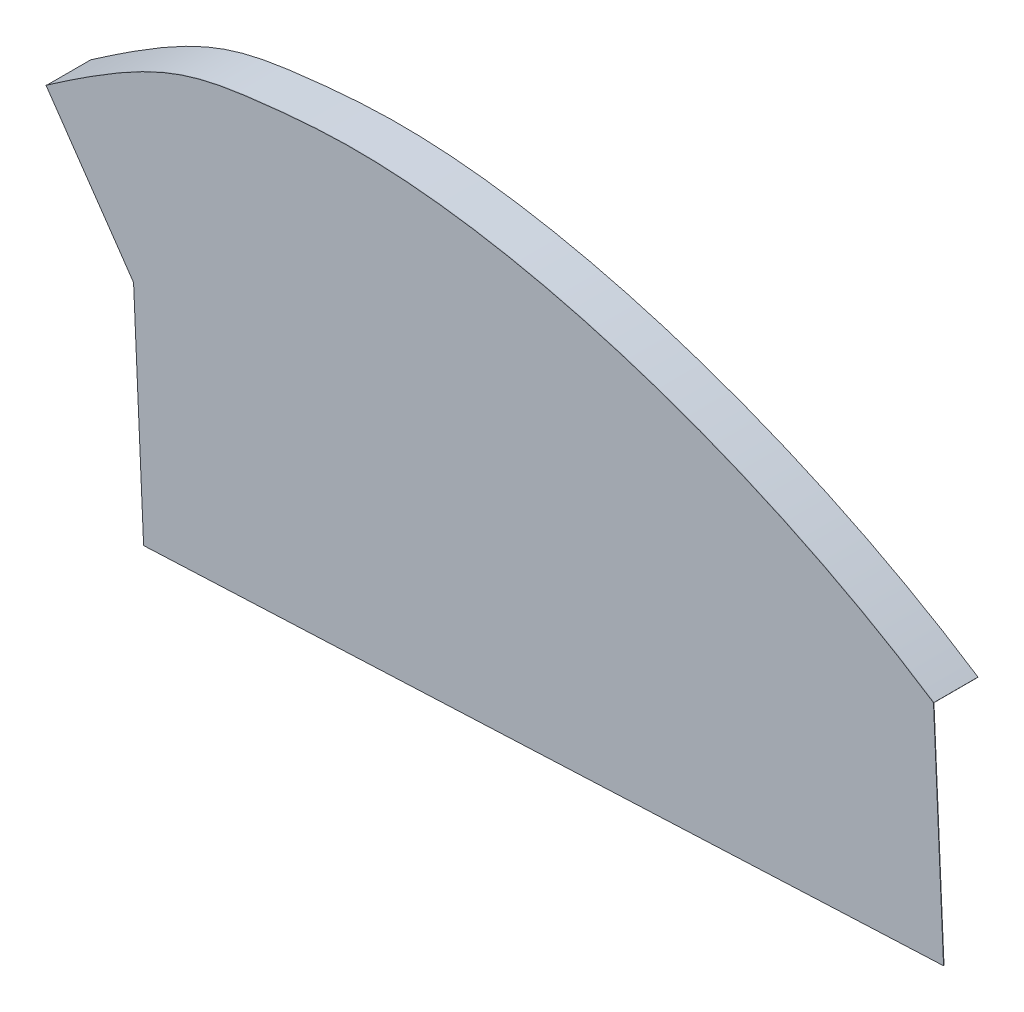
ISO-10303-21;
HEADER;
FILE_DESCRIPTION(('STEP AP214'),'2;1');
FILE_NAME('part.step','',(''),(''),'','','');
FILE_SCHEMA(('AUTOMOTIVE_DESIGN { 1 0 10303 214 1 1 1 1 }'));
ENDSEC;
DATA;
#1=APPLICATION_CONTEXT('core data for automotive mechanical design processes');
#2=APPLICATION_PROTOCOL_DEFINITION('international standard','automotive_design',2000,#1);
#3=PRODUCT_CONTEXT('',#1,'mechanical');
#4=PRODUCT('Part','Part','',(#3));
#5=PRODUCT_RELATED_PRODUCT_CATEGORY('part','',(#4));
#6=PRODUCT_DEFINITION_FORMATION('','',#4);
#7=PRODUCT_DEFINITION_CONTEXT('part definition',#1,'design');
#8=PRODUCT_DEFINITION('design','',#6,#7);
#9=PRODUCT_DEFINITION_SHAPE('','',#8);
#10=(LENGTH_UNIT() NAMED_UNIT(*) SI_UNIT(.MILLI.,.METRE.));
#11=(NAMED_UNIT(*) PLANE_ANGLE_UNIT() SI_UNIT($,.RADIAN.));
#12=(NAMED_UNIT(*) SI_UNIT($,.STERADIAN.) SOLID_ANGLE_UNIT());
#13=UNCERTAINTY_MEASURE_WITH_UNIT(LENGTH_MEASURE(1.E-05),#10,'distance_accuracy_value','');
#14=(GEOMETRIC_REPRESENTATION_CONTEXT(3) GLOBAL_UNCERTAINTY_ASSIGNED_CONTEXT((#13)) GLOBAL_UNIT_ASSIGNED_CONTEXT((#10,
#11,#12)) REPRESENTATION_CONTEXT('',''));
#15=CARTESIAN_POINT('',(0.,0.,0.));
#16=DIRECTION('',(0.,0.,1.));
#17=DIRECTION('',(1.,0.,0.));
#18=AXIS2_PLACEMENT_3D('',#15,#16,#17);
#19=CARTESIAN_POINT('',(-1659.53553734202,615.24308702669,0.));
#20=DIRECTION('',(0.,0.,1.));
#21=DIRECTION('',(1.,0.,0.));
#22=AXIS2_PLACEMENT_3D('',#19,#20,#21);
#23=PLANE('',#22);
#24=CARTESIAN_POINT('',(-1544.64995665935,573.441433080312,0.));
#25=CARTESIAN_POINT('',(-1585.71664888804,600.423930322912,0.));
#26=CARTESIAN_POINT('',(-1646.28028973819,619.241808081414,0.));
#27=CARTESIAN_POINT('',(-1709.38954114273,613.399774738818,0.));
#28=CARTESIAN_POINT('',(-1719.50790421298,610.537812827554,0.));
#29=CARTESIAN_POINT('',(-1743.60796018332,593.83047017767,0.));
#30=B_SPLINE_CURVE_WITH_KNOTS('',3,(#24,#25,#26,#27,#28,#29),.UNSPECIFIED.,.F.,.F.,(4,1,1,4),
(0.,0.579445357910707,0.679445357910707,1.),.UNSPECIFIED.);
#31=CARTESIAN_POINT('',(-1544.64995665935,573.441433080312,0.));
#32=VERTEX_POINT('',#31);
#33=CARTESIAN_POINT('',(-1743.60796018332,593.83047017767,0.));
#34=VERTEX_POINT('',#33);
#35=EDGE_CURVE('E122',#32,#34,#30,.T.);
#36=ORIENTED_EDGE('',*,*,#35,.F.);
#37=DIRECTION('',(-0.0450522481090854,0.998984631984055,0.));
#38=VECTOR('',#37,1.);
#39=CARTESIAN_POINT('',(-1544.64995665935,573.441433080312,0.));
#40=LINE('',#39,#38);
#41=CARTESIAN_POINT('',(-1542.39734425389,523.492201481109,0.));
#42=VERTEX_POINT('',#41);
#43=EDGE_CURVE('E82',#42,#32,#40,.T.);
#44=ORIENTED_EDGE('',*,*,#43,.F.);
#45=DIRECTION('',(0.998984631984055,0.0450522481090856,0.));
#46=VECTOR('',#45,1.);
#47=CARTESIAN_POINT('',(-1542.39734425389,523.492201481109,0.));
#48=LINE('',#47,#46);
#49=CARTESIAN_POINT('',(-1721.7229636347,515.404967665896,0.));
#50=VERTEX_POINT('',#49);
#51=EDGE_CURVE('E134',#50,#42,#48,.T.);
#52=ORIENTED_EDGE('',*,*,#51,.F.);
#53=DIRECTION('',(0.0450522481090854,-0.998984631984055,0.));
#54=VECTOR('',#53,1.);
#55=CARTESIAN_POINT('',(-1723.97557604015,565.354199265099,0.));
#56=LINE('',#55,#54);
#57=CARTESIAN_POINT('',(-1723.97557604015,565.354199265099,0.));
#58=VERTEX_POINT('',#57);
#59=EDGE_CURVE('E110',#58,#50,#56,.T.);
#60=ORIENTED_EDGE('',*,*,#59,.F.);
#61=DIRECTION('',(0.567607096396232,-0.823299571310856,0.));
#62=VECTOR('',#61,1.);
#63=CARTESIAN_POINT('',(-1743.60796018332,593.83047017767,0.));
#64=LINE('',#63,#62);
#65=EDGE_CURVE('E127',#34,#58,#64,.T.);
#66=ORIENTED_EDGE('',*,*,#65,.F.);
#67=EDGE_LOOP('',(#36,#44,#52,#60,#66));
#68=FACE_BOUND('',#67,.T.);
#69=DIRECTION('',(-0.549118385868169,-0.835744577189428,0.));
#70=VECTOR('',#69,1.);
#71=CARTESIAN_POINT('',(-1560.10779243697,549.914990042341,0.));
#72=LINE('',#71,#70);
#73=CARTESIAN_POINT('',(-1544.67741257864,573.399645851452,0.));
#74=VERTEX_POINT('',#73);
#75=CARTESIAN_POINT('',(-1544.73232441723,573.316071393733,0.));
#76=VERTEX_POINT('',#75);
#77=EDGE_CURVE('E11',#74,#76,#72,.T.);
#78=ORIENTED_EDGE('',*,*,#77,.F.);
#79=CARTESIAN_POINT('',(-1544.67741257864,573.399645851452,0.));
#80=CARTESIAN_POINT('',(-1580.10630688182,596.677879158398,0.));
#81=CARTESIAN_POINT('',(-1623.41727661125,611.817205851016,0.));
#82=CARTESIAN_POINT('',(-1664.05555432562,615.615316248625,0.));
#83=CARTESIAN_POINT('',(-1668.45858748525,615.853546331745,0.));
#84=CARTESIAN_POINT('',(-1674.85045688565,615.924640205925,0.));
#85=CARTESIAN_POINT('',(-1676.94707234617,615.898899542227,0.));
#86=CARTESIAN_POINT('',(-1681.053950245,615.760083503958,0.));
#87=CARTESIAN_POINT('',(-1685.070934683,615.538033819222,0.));
#88=CARTESIAN_POINT('',(-1688.84153528557,615.206941308899,0.));
#89=CARTESIAN_POINT('',(-1692.45566082211,614.850042830177,0.));
#90=CARTESIAN_POINT('',(-1694.1825533992,614.660043123166,0.));
#91=CARTESIAN_POINT('',(-1699.09217730466,614.084892782621,0.));
#92=CARTESIAN_POINT('',(-1702.0267403375,613.678931578794,0.));
#93=CARTESIAN_POINT('',(-1710.3914540648,612.076086015253,0.));
#94=CARTESIAN_POINT('',(-1715.38281240301,610.494610735516,0.));
#95=CARTESIAN_POINT('',(-1727.27852043395,604.608644100186,0.));
#96=CARTESIAN_POINT('',(-1734.18262553921,600.30373530969,0.));
#97=CARTESIAN_POINT('',(-1743.57947353923,593.789378680877,0.));
#98=B_SPLINE_CURVE_WITH_KNOTS('',3,(#79,#80,#81,#82,#83,#84,#85,#86,#87,#88,#89,#90,#91,#92,#93,
#94,#95,#96,#97),.UNSPECIFIED.,.F.,.F.,(4,2,2,2,1,2,2,2,2,4),(0.,0.499999999999989,
0.562499999999988,0.593749999999988,0.624999999999989,0.65624999999999,0.687499999999991,
0.749999999999993,0.874999999999996,1.),.UNSPECIFIED.);
#99=CARTESIAN_POINT('',(-1743.57947353923,593.789378680877,0.));
#100=VERTEX_POINT('',#99);
#101=EDGE_CURVE('E143',#74,#100,#98,.T.);
#102=ORIENTED_EDGE('',*,*,#101,.T.);
#103=DIRECTION('',(0.569732881743784,-0.821829935850431,0.));
#104=VECTOR('',#103,1.);
#105=CARTESIAN_POINT('',(-1726.34431651298,568.927959501592,0.));
#106=LINE('',#105,#104);
#107=CARTESIAN_POINT('',(-1743.52250025105,593.707195687292,0.));
#108=VERTEX_POINT('',#107);
#109=EDGE_CURVE('E148',#100,#108,#106,.T.);
#110=ORIENTED_EDGE('',*,*,#109,.T.);
#111=CARTESIAN_POINT('',(-1544.73232441723,573.316071393733,0.));
#112=CARTESIAN_POINT('',(-1546.9519488348,574.774455463074,0.));
#113=CARTESIAN_POINT('',(-1551.43127800974,577.613556033188,0.));
#114=CARTESIAN_POINT('',(-1560.62942944249,583.045346230826,0.));
#115=CARTESIAN_POINT('',(-1572.47093595197,589.326889692186,0.));
#116=CARTESIAN_POINT('',(-1587.0698673746,596.019330748109,0.));
#117=CARTESIAN_POINT('',(-1606.81265126061,603.755089395571,0.));
#118=CARTESIAN_POINT('',(-1626.62090438922,609.625271880809,0.));
#119=CARTESIAN_POINT('',(-1645.78545252912,613.461587482119,0.));
#120=CARTESIAN_POINT('',(-1659.66402273344,615.275078476153,0.));
#121=CARTESIAN_POINT('',(-1672.85543086534,616.000525973034,0.));
#122=CARTESIAN_POINT('',(-1683.17584633953,615.607177852822,0.));
#123=CARTESIAN_POINT('',(-1690.71915152159,614.940047919185,0.));
#124=CARTESIAN_POINT('',(-1697.61941057258,614.184343592506,0.));
#125=CARTESIAN_POINT('',(-1704.94143994043,613.175751133432,0.));
#126=CARTESIAN_POINT('',(-1711.53706287152,611.5205858769,0.));
#127=CARTESIAN_POINT('',(-1716.95073175608,609.496349747706,0.));
#128=CARTESIAN_POINT('',(-1721.22633977372,607.547139739651,0.));
#129=CARTESIAN_POINT('',(-1725.86182003669,605.087085053395,0.));
#130=CARTESIAN_POINT('',(-1730.14437771435,602.544994912,0.));
#131=CARTESIAN_POINT('',(-1733.8948142354,600.175895508009,0.));
#132=CARTESIAN_POINT('',(-1736.8860842667,598.222624563629,0.));
#133=CARTESIAN_POINT('',(-1739.54836201676,596.435520579365,0.));
#134=CARTESIAN_POINT('',(-1741.77568270842,594.914415574359,0.));
#135=CARTESIAN_POINT('',(-1742.94582133205,594.106977841768,0.));
#136=CARTESIAN_POINT('',(-1743.52250025105,593.707195687292,0.));
#137=B_SPLINE_CURVE_WITH_KNOTS('',3,(#111,#112,#113,#114,#115,#116,#117,#118,#119,#120,#121,
#122,#123,#124,#125,#126,#127,#128,#129,#130,#131,#132,#133,#134,#135,#136),.UNSPECIFIED.,.F.,
.F.,(4,1,1,1,1,1,1,1,1,1,1,1,1,1,1,1,1,1,1,1,1,1,1,4),(0.,0.03125,0.0625,0.125,0.1875,0.25,
0.375,0.4375,0.5,0.5625,0.625,0.65625,0.6875,0.75,0.8125,0.84375,0.875,0.90625,0.9375,0.953125,
0.96875,0.984375,0.9921875,1.),.UNSPECIFIED.);
#138=EDGE_CURVE('E42',#76,#108,#137,.T.);
#139=ORIENTED_EDGE('',*,*,#138,.F.);
#140=EDGE_LOOP('',(#78,#102,#110,#139));
#141=FACE_BOUND('',#140,.T.);
#142=ADVANCED_FACE('F33',(#68,#141),#23,.F.);
#143=CARTESIAN_POINT('',(-1544.64995665935,573.441433080312,0.1));
#144=CARTESIAN_POINT('',(-1585.71664888804,600.423930322912,0.1));
#145=CARTESIAN_POINT('',(-1646.28028973819,619.241808081414,0.1));
#146=CARTESIAN_POINT('',(-1709.38954114273,613.399774738818,0.1));
#147=CARTESIAN_POINT('',(-1719.50790421298,610.537812827554,0.1));
#148=CARTESIAN_POINT('',(-1743.60796018332,593.83047017767,0.1));
#149=B_SPLINE_CURVE_WITH_KNOTS('',3,(#143,#144,#145,#146,#147,#148),.UNSPECIFIED.,.F.,.F.,(4,1,
1,4),(0.,0.579445357910707,0.679445357910707,1.),.UNSPECIFIED.);
#150=DIRECTION('',(0.,0.,-1.));
#151=VECTOR('',#150,1.);
#152=SURFACE_OF_LINEAR_EXTRUSION('',#149,#151);
#153=ORIENTED_EDGE('',*,*,#35,.T.);
#154=DIRECTION('',(0.,0.,-1.));
#155=VECTOR('',#154,1.);
#156=CARTESIAN_POINT('',(-1743.60796018332,593.83047017767,0.1));
#157=LINE('',#156,#155);
#158=CARTESIAN_POINT('',(-1743.60796018332,593.83047017767,0.1));
#159=VERTEX_POINT('',#158);
#160=EDGE_CURVE('E141',#159,#34,#157,.T.);
#161=ORIENTED_EDGE('',*,*,#160,.F.);
#162=CARTESIAN_POINT('',(-1544.64995665935,573.441433080312,0.1));
#163=VERTEX_POINT('',#162);
#164=EDGE_CURVE('E137',#163,#159,#149,.T.);
#165=ORIENTED_EDGE('',*,*,#164,.F.);
#166=DIRECTION('',(0.,0.,-1.));
#167=VECTOR('',#166,1.);
#168=CARTESIAN_POINT('',(-1544.64995665935,573.441433080312,0.1));
#169=LINE('',#168,#167);
#170=EDGE_CURVE('E118',#163,#32,#169,.T.);
#171=ORIENTED_EDGE('',*,*,#170,.T.);
#172=EDGE_LOOP('',(#153,#161,#165,#171));
#173=FACE_BOUND('',#172,.T.);
#174=ADVANCED_FACE('F35',(#173),#152,.F.);
#175=CARTESIAN_POINT('',(-1743.60796018332,593.83047017767,0.1));
#176=DIRECTION('',(0.823299571310856,0.567607096396232,0.));
#177=DIRECTION('',(-0.567607096396232,0.823299571310856,0.));
#178=AXIS2_PLACEMENT_3D('',#175,#176,#177);
#179=PLANE('',#178);
#180=ORIENTED_EDGE('',*,*,#65,.T.);
#181=DIRECTION('',(0.,0.,-1.));
#182=VECTOR('',#181,1.);
#183=CARTESIAN_POINT('',(-1723.97557604015,565.354199265099,0.1));
#184=LINE('',#183,#182);
#185=CARTESIAN_POINT('',(-1723.97557604015,565.354199265099,0.1));
#186=VERTEX_POINT('',#185);
#187=EDGE_CURVE('E113',#186,#58,#184,.T.);
#188=ORIENTED_EDGE('',*,*,#187,.F.);
#189=DIRECTION('',(0.567607096396232,-0.823299571310856,0.));
#190=VECTOR('',#189,1.);
#191=CARTESIAN_POINT('',(-1743.60796018332,593.83047017767,0.1));
#192=LINE('',#191,#190);
#193=EDGE_CURVE('E91',#159,#186,#192,.T.);
#194=ORIENTED_EDGE('',*,*,#193,.F.);
#195=ORIENTED_EDGE('',*,*,#160,.T.);
#196=EDGE_LOOP('',(#180,#188,#194,#195));
#197=FACE_BOUND('',#196,.T.);
#198=ADVANCED_FACE('F207',(#197),#179,.F.);
#199=CARTESIAN_POINT('',(-1723.97557604015,565.354199265099,0.1));
#200=DIRECTION('',(0.998984631984055,0.0450522481090854,0.));
#201=DIRECTION('',(-0.0450522481090854,0.998984631984055,0.));
#202=AXIS2_PLACEMENT_3D('',#199,#200,#201);
#203=PLANE('',#202);
#204=ORIENTED_EDGE('',*,*,#59,.T.);
#205=DIRECTION('',(0.,0.,-1.));
#206=VECTOR('',#205,1.);
#207=CARTESIAN_POINT('',(-1721.7229636347,515.404967665896,0.1));
#208=LINE('',#207,#206);
#209=CARTESIAN_POINT('',(-1721.7229636347,515.404967665896,0.1));
#210=VERTEX_POINT('',#209);
#211=EDGE_CURVE('E107',#210,#50,#208,.T.);
#212=ORIENTED_EDGE('',*,*,#211,.F.);
#213=DIRECTION('',(0.0450522481090854,-0.998984631984055,0.));
#214=VECTOR('',#213,1.);
#215=CARTESIAN_POINT('',(-1723.97557604015,565.354199265099,0.1));
#216=LINE('',#215,#214);
#217=EDGE_CURVE('E97',#186,#210,#216,.T.);
#218=ORIENTED_EDGE('',*,*,#217,.F.);
#219=ORIENTED_EDGE('',*,*,#187,.T.);
#220=EDGE_LOOP('',(#204,#212,#218,#219));
#221=FACE_BOUND('',#220,.T.);
#222=ADVANCED_FACE('F108',(#221),#203,.F.);
#223=CARTESIAN_POINT('',(-1542.39734425389,523.492201481109,0.1));
#224=DIRECTION('',(-0.0450522481090856,0.998984631984055,0.));
#225=DIRECTION('',(-0.998984631984055,-0.0450522481090857,0.));
#226=AXIS2_PLACEMENT_3D('',#223,#224,#225);
#227=PLANE('',#226);
#228=ORIENTED_EDGE('',*,*,#51,.T.);
#229=DIRECTION('',(0.,0.,-1.));
#230=VECTOR('',#229,1.);
#231=CARTESIAN_POINT('',(-1542.39734425389,523.492201481109,0.1));
#232=LINE('',#231,#230);
#233=CARTESIAN_POINT('',(-1542.39734425389,523.492201481109,0.1));
#234=VERTEX_POINT('',#233);
#235=EDGE_CURVE('E114',#234,#42,#232,.T.);
#236=ORIENTED_EDGE('',*,*,#235,.F.);
#237=DIRECTION('',(0.998984631984055,0.0450522481090856,0.));
#238=VECTOR('',#237,1.);
#239=CARTESIAN_POINT('',(-1542.39734425389,523.492201481109,0.1));
#240=LINE('',#239,#238);
#241=EDGE_CURVE('E101',#210,#234,#240,.T.);
#242=ORIENTED_EDGE('',*,*,#241,.F.);
#243=ORIENTED_EDGE('',*,*,#211,.T.);
#244=EDGE_LOOP('',(#228,#236,#242,#243));
#245=FACE_BOUND('',#244,.T.);
#246=ADVANCED_FACE('F116',(#245),#227,.F.);
#247=CARTESIAN_POINT('',(-1544.64995665935,573.441433080312,0.1));
#248=DIRECTION('',(-0.998984631984055,-0.0450522481090854,0.));
#249=DIRECTION('',(0.0450522481090854,-0.998984631984055,0.));
#250=AXIS2_PLACEMENT_3D('',#247,#248,#249);
#251=PLANE('',#250);
#252=ORIENTED_EDGE('',*,*,#43,.T.);
#253=ORIENTED_EDGE('',*,*,#170,.F.);
#254=DIRECTION('',(-0.0450522481090854,0.998984631984055,0.));
#255=VECTOR('',#254,1.);
#256=CARTESIAN_POINT('',(-1544.64995665935,573.441433080312,0.1));
#257=LINE('',#256,#255);
#258=EDGE_CURVE('E58',#234,#163,#257,.T.);
#259=ORIENTED_EDGE('',*,*,#258,.F.);
#260=ORIENTED_EDGE('',*,*,#235,.T.);
#261=EDGE_LOOP('',(#252,#253,#259,#260));
#262=FACE_BOUND('',#261,.T.);
#263=ADVANCED_FACE('F209',(#262),#251,.F.);
#264=CARTESIAN_POINT('',(-1659.53553734202,615.24308702669,0.1));
#265=DIRECTION('',(0.,0.,1.));
#266=DIRECTION('',(1.,0.,0.));
#267=AXIS2_PLACEMENT_3D('',#264,#265,#266);
#268=PLANE('',#267);
#269=ORIENTED_EDGE('',*,*,#164,.T.);
#270=ORIENTED_EDGE('',*,*,#193,.T.);
#271=ORIENTED_EDGE('',*,*,#217,.T.);
#272=ORIENTED_EDGE('',*,*,#241,.T.);
#273=ORIENTED_EDGE('',*,*,#258,.T.);
#274=EDGE_LOOP('',(#269,#270,#271,#272,#273));
#275=FACE_BOUND('',#274,.T.);
#276=ADVANCED_FACE('F99',(#275),#268,.T.);
#277=CARTESIAN_POINT('',(-1342.05540629883,881.785318824068,-9.9));
#278=DIRECTION('',(-0.835744577189428,0.549118385868169,0.));
#279=DIRECTION('',(-0.549118385868169,-0.835744577189428,0.));
#280=AXIS2_PLACEMENT_3D('',#277,#278,#279);
#281=PLANE('',#280);
#282=DIRECTION('',(0.,0.,1.));
#283=VECTOR('',#282,1.);
#284=CARTESIAN_POINT('',(-1544.67741257864,573.399645851452,-9.9));
#285=LINE('',#284,#283);
#286=CARTESIAN_POINT('',(-1544.67741257864,573.399645851452,-9.9));
#287=VERTEX_POINT('',#286);
#288=EDGE_CURVE('E183',#287,#74,#285,.T.);
#289=ORIENTED_EDGE('',*,*,#288,.T.);
#290=ORIENTED_EDGE('',*,*,#77,.T.);
#291=DIRECTION('',(0.,0.,1.));
#292=VECTOR('',#291,1.);
#293=CARTESIAN_POINT('',(-1544.73232441723,573.316071393733,-9.9));
#294=LINE('',#293,#292);
#295=CARTESIAN_POINT('',(-1544.73232441723,573.316071393733,-9.9));
#296=VERTEX_POINT('',#295);
#297=EDGE_CURVE('E128',#296,#76,#294,.T.);
#298=ORIENTED_EDGE('',*,*,#297,.F.);
#299=DIRECTION('',(-0.549118385868169,-0.835744577189428,0.));
#300=VECTOR('',#299,1.);
#301=CARTESIAN_POINT('',(-1342.05540629883,881.785318824068,-9.9));
#302=LINE('',#301,#300);
#303=EDGE_CURVE('E190',#287,#296,#302,.T.);
#304=ORIENTED_EDGE('',*,*,#303,.F.);
#305=EDGE_LOOP('',(#289,#290,#298,#304));
#306=FACE_BOUND('',#305,.T.);
#307=ADVANCED_FACE('F188',(#306),#281,.F.);
#308=CARTESIAN_POINT('',(-1544.73232441723,573.316071393733,-9.9));
#309=CARTESIAN_POINT('',(-1546.9519488348,574.774455463074,-9.9));
#310=CARTESIAN_POINT('',(-1551.43127800974,577.613556033188,-9.9));
#311=CARTESIAN_POINT('',(-1560.62942944249,583.045346230826,-9.9));
#312=CARTESIAN_POINT('',(-1572.47093595197,589.326889692186,-9.9));
#313=CARTESIAN_POINT('',(-1587.0698673746,596.019330748109,-9.9));
#314=CARTESIAN_POINT('',(-1606.81265126061,603.755089395571,-9.9));
#315=CARTESIAN_POINT('',(-1626.62090438922,609.625271880809,-9.9));
#316=CARTESIAN_POINT('',(-1645.78545252912,613.461587482119,-9.9));
#317=CARTESIAN_POINT('',(-1659.66402273344,615.275078476153,-9.9));
#318=CARTESIAN_POINT('',(-1672.85543086534,616.000525973034,-9.9));
#319=CARTESIAN_POINT('',(-1683.17584633953,615.607177852822,-9.9));
#320=CARTESIAN_POINT('',(-1690.71915152159,614.940047919185,-9.9));
#321=CARTESIAN_POINT('',(-1697.61941057258,614.184343592506,-9.9));
#322=CARTESIAN_POINT('',(-1704.94143994043,613.175751133432,-9.9));
#323=CARTESIAN_POINT('',(-1711.53706287152,611.5205858769,-9.9));
#324=CARTESIAN_POINT('',(-1716.95073175608,609.496349747706,-9.9));
#325=CARTESIAN_POINT('',(-1721.22633977372,607.547139739651,-9.9));
#326=CARTESIAN_POINT('',(-1725.86182003669,605.087085053395,-9.9));
#327=CARTESIAN_POINT('',(-1730.14437771435,602.544994912,-9.9));
#328=CARTESIAN_POINT('',(-1733.8948142354,600.175895508009,-9.9));
#329=CARTESIAN_POINT('',(-1736.8860842667,598.222624563629,-9.9));
#330=CARTESIAN_POINT('',(-1739.54836201676,596.435520579365,-9.9));
#331=CARTESIAN_POINT('',(-1741.77568270842,594.914415574359,-9.9));
#332=CARTESIAN_POINT('',(-1742.94582133205,594.106977841768,-9.9));
#333=CARTESIAN_POINT('',(-1743.52250025105,593.707195687292,-9.9));
#334=B_SPLINE_CURVE_WITH_KNOTS('',3,(#308,#309,#310,#311,#312,#313,#314,#315,#316,#317,#318,
#319,#320,#321,#322,#323,#324,#325,#326,#327,#328,#329,#330,#331,#332,#333),.UNSPECIFIED.,.F.,
.F.,(4,1,1,1,1,1,1,1,1,1,1,1,1,1,1,1,1,1,1,1,1,1,1,4),(0.,0.03125,0.0625,0.125,0.1875,0.25,
0.375,0.4375,0.5,0.5625,0.625,0.65625,0.6875,0.75,0.8125,0.84375,0.875,0.90625,0.9375,0.953125,
0.96875,0.984375,0.9921875,1.),.UNSPECIFIED.);
#335=DIRECTION('',(0.,0.,1.));
#336=VECTOR('',#335,1.);
#337=SURFACE_OF_LINEAR_EXTRUSION('',#334,#336);
#338=ORIENTED_EDGE('',*,*,#297,.T.);
#339=ORIENTED_EDGE('',*,*,#138,.T.);
#340=DIRECTION('',(0.,0.,1.));
#341=VECTOR('',#340,1.);
#342=CARTESIAN_POINT('',(-1743.52250025105,593.707195687292,-9.9));
#343=LINE('',#342,#341);
#344=CARTESIAN_POINT('',(-1743.52250025105,593.707195687292,-9.9));
#345=VERTEX_POINT('',#344);
#346=EDGE_CURVE('E168',#345,#108,#343,.T.);
#347=ORIENTED_EDGE('',*,*,#346,.F.);
#348=EDGE_CURVE('E192',#296,#345,#334,.T.);
#349=ORIENTED_EDGE('',*,*,#348,.F.);
#350=EDGE_LOOP('',(#338,#339,#347,#349));
#351=FACE_BOUND('',#350,.T.);
#352=ADVANCED_FACE('F165',(#351),#337,.F.);
#353=CARTESIAN_POINT('',(-899.595160445761,-623.643555443328,-9.9));
#354=DIRECTION('',(-0.821829935850431,-0.569732881743784,0.));
#355=DIRECTION('',(0.569732881743784,-0.821829935850431,0.));
#356=AXIS2_PLACEMENT_3D('',#353,#354,#355);
#357=PLANE('',#356);
#358=ORIENTED_EDGE('',*,*,#109,.F.);
#359=DIRECTION('',(0.,0.,1.));
#360=VECTOR('',#359,1.);
#361=CARTESIAN_POINT('',(-1743.57947353923,593.789378680877,-9.9));
#362=LINE('',#361,#360);
#363=CARTESIAN_POINT('',(-1743.57947353923,593.789378680877,-9.9));
#364=VERTEX_POINT('',#363);
#365=EDGE_CURVE('E49',#364,#100,#362,.T.);
#366=ORIENTED_EDGE('',*,*,#365,.F.);
#367=DIRECTION('',(0.569732881743784,-0.821829935850431,0.));
#368=VECTOR('',#367,1.);
#369=CARTESIAN_POINT('',(-899.595160445761,-623.643555443328,-9.9));
#370=LINE('',#369,#368);
#371=EDGE_CURVE('E177',#364,#345,#370,.T.);
#372=ORIENTED_EDGE('',*,*,#371,.T.);
#373=ORIENTED_EDGE('',*,*,#346,.T.);
#374=EDGE_LOOP('',(#358,#366,#372,#373));
#375=FACE_BOUND('',#374,.T.);
#376=ADVANCED_FACE('F175',(#375),#357,.T.);
#377=CARTESIAN_POINT('',(-1544.67741257864,573.399645851452,-9.9));
#378=CARTESIAN_POINT('',(-1580.10630688182,596.677879158398,-9.9));
#379=CARTESIAN_POINT('',(-1623.41727661125,611.817205851016,-9.9));
#380=CARTESIAN_POINT('',(-1664.05555432562,615.615316248625,-9.9));
#381=CARTESIAN_POINT('',(-1668.45858748525,615.853546331745,-9.9));
#382=CARTESIAN_POINT('',(-1674.85045688565,615.924640205925,-9.9));
#383=CARTESIAN_POINT('',(-1676.94707234617,615.898899542227,-9.9));
#384=CARTESIAN_POINT('',(-1681.053950245,615.760083503958,-9.9));
#385=CARTESIAN_POINT('',(-1685.070934683,615.538033819222,-9.9));
#386=CARTESIAN_POINT('',(-1688.84153528557,615.206941308899,-9.9));
#387=CARTESIAN_POINT('',(-1692.45566082211,614.850042830177,-9.9));
#388=CARTESIAN_POINT('',(-1694.1825533992,614.660043123166,-9.9));
#389=CARTESIAN_POINT('',(-1699.09217730466,614.084892782621,-9.9));
#390=CARTESIAN_POINT('',(-1702.0267403375,613.678931578794,-9.9));
#391=CARTESIAN_POINT('',(-1710.3914540648,612.076086015253,-9.9));
#392=CARTESIAN_POINT('',(-1715.38281240301,610.494610735516,-9.9));
#393=CARTESIAN_POINT('',(-1727.27852043395,604.608644100186,-9.9));
#394=CARTESIAN_POINT('',(-1734.18262553921,600.30373530969,-9.9));
#395=CARTESIAN_POINT('',(-1743.57947353923,593.789378680877,-9.9));
#396=B_SPLINE_CURVE_WITH_KNOTS('',3,(#377,#378,#379,#380,#381,#382,#383,#384,#385,#386,#387,
#388,#389,#390,#391,#392,#393,#394,#395),.UNSPECIFIED.,.F.,.F.,(4,2,2,2,1,2,2,2,2,4),(0.,
0.499999999999989,0.562499999999988,0.593749999999988,0.624999999999989,0.65624999999999,
0.687499999999991,0.749999999999993,0.874999999999996,1.),.UNSPECIFIED.);
#397=DIRECTION('',(0.,0.,1.));
#398=VECTOR('',#397,1.);
#399=SURFACE_OF_LINEAR_EXTRUSION('',#396,#398);
#400=ORIENTED_EDGE('',*,*,#101,.F.);
#401=ORIENTED_EDGE('',*,*,#288,.F.);
#402=EDGE_CURVE('E231',#287,#364,#396,.T.);
#403=ORIENTED_EDGE('',*,*,#402,.T.);
#404=ORIENTED_EDGE('',*,*,#365,.T.);
#405=EDGE_LOOP('',(#400,#401,#403,#404));
#406=FACE_BOUND('',#405,.T.);
#407=ADVANCED_FACE('F181',(#406),#399,.T.);
#408=CARTESIAN_POINT('',(0.,0.,-9.9));
#409=DIRECTION('',(0.,0.,1.));
#410=DIRECTION('',(1.,0.,0.));
#411=AXIS2_PLACEMENT_3D('',#408,#409,#410);
#412=PLANE('',#411);
#413=ORIENTED_EDGE('',*,*,#303,.T.);
#414=ORIENTED_EDGE('',*,*,#348,.T.);
#415=ORIENTED_EDGE('',*,*,#371,.F.);
#416=ORIENTED_EDGE('',*,*,#402,.F.);
#417=EDGE_LOOP('',(#413,#414,#415,#416));
#418=FACE_BOUND('',#417,.T.);
#419=ADVANCED_FACE('F229',(#418),#412,.F.);
#420=CLOSED_SHELL('',(#142,#174,#198,#222,#246,#263,#276,#307,#352,#376,#407,#419));
#421=MANIFOLD_SOLID_BREP('B2',#420);
#422=ADVANCED_BREP_SHAPE_REPRESENTATION('',(#18,#421),#14);
#423=SHAPE_DEFINITION_REPRESENTATION(#9,#422);
ENDSEC;
END-ISO-10303-21;
